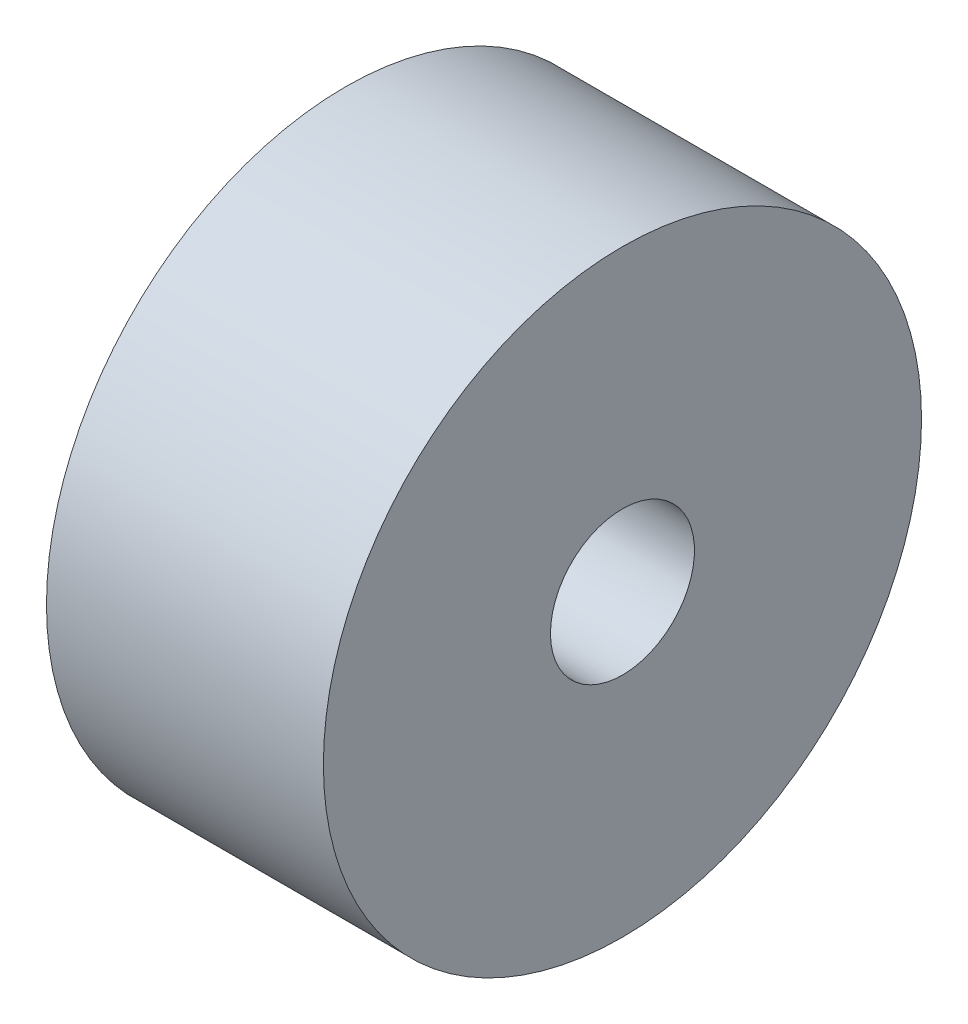
ISO-10303-21;
HEADER;
FILE_DESCRIPTION(('STEP AP214'),'2;1');
FILE_NAME('part.step','',(''),(''),'','','');
FILE_SCHEMA(('AUTOMOTIVE_DESIGN { 1 0 10303 214 1 1 1 1 }'));
ENDSEC;
DATA;
#1=APPLICATION_CONTEXT('core data for automotive mechanical design processes');
#2=APPLICATION_PROTOCOL_DEFINITION('international standard','automotive_design',2000,#1);
#3=PRODUCT_CONTEXT('',#1,'mechanical');
#4=PRODUCT('Part','Part','',(#3));
#5=PRODUCT_RELATED_PRODUCT_CATEGORY('part','',(#4));
#6=PRODUCT_DEFINITION_FORMATION('','',#4);
#7=PRODUCT_DEFINITION_CONTEXT('part definition',#1,'design');
#8=PRODUCT_DEFINITION('design','',#6,#7);
#9=PRODUCT_DEFINITION_SHAPE('','',#8);
#10=(LENGTH_UNIT() NAMED_UNIT(*) SI_UNIT(.MILLI.,.METRE.));
#11=(NAMED_UNIT(*) PLANE_ANGLE_UNIT() SI_UNIT($,.RADIAN.));
#12=(NAMED_UNIT(*) SI_UNIT($,.STERADIAN.) SOLID_ANGLE_UNIT());
#13=UNCERTAINTY_MEASURE_WITH_UNIT(LENGTH_MEASURE(1.E-05),#10,'distance_accuracy_value','');
#14=(GEOMETRIC_REPRESENTATION_CONTEXT(3) GLOBAL_UNCERTAINTY_ASSIGNED_CONTEXT((#13)) GLOBAL_UNIT_ASSIGNED_CONTEXT((#10,
#11,#12)) REPRESENTATION_CONTEXT('',''));
#15=CARTESIAN_POINT('',(0.,0.,0.));
#16=DIRECTION('',(0.,0.,1.));
#17=DIRECTION('',(1.,0.,0.));
#18=AXIS2_PLACEMENT_3D('',#15,#16,#17);
#19=CARTESIAN_POINT('',(0.,0.,0.));
#20=DIRECTION('',(-1.,0.,0.));
#21=DIRECTION('',(0.,0.,1.));
#22=AXIS2_PLACEMENT_3D('',#19,#20,#21);
#23=CYLINDRICAL_SURFACE('',#22,27.);
#24=CARTESIAN_POINT('',(12.5,0.,0.));
#25=DIRECTION('',(-1.,0.,0.));
#26=DIRECTION('',(0.,0.,1.));
#27=AXIS2_PLACEMENT_3D('',#24,#25,#26);
#28=CIRCLE('',#27,27.);
#29=CARTESIAN_POINT('',(12.5,0.,27.));
#30=VERTEX_POINT('',#29);
#31=EDGE_CURVE('E46',#30,#30,#28,.T.);
#32=ORIENTED_EDGE('',*,*,#31,.T.);
#33=EDGE_LOOP('',(#32));
#34=FACE_BOUND('',#33,.T.);
#35=CARTESIAN_POINT('',(-12.5,0.,0.));
#36=DIRECTION('',(-1.,0.,0.));
#37=DIRECTION('',(0.,0.,1.));
#38=AXIS2_PLACEMENT_3D('',#35,#36,#37);
#39=CIRCLE('',#38,27.);
#40=CARTESIAN_POINT('',(-12.5,0.,27.));
#41=VERTEX_POINT('',#40);
#42=EDGE_CURVE('E10',#41,#41,#39,.T.);
#43=ORIENTED_EDGE('',*,*,#42,.F.);
#44=EDGE_LOOP('',(#43));
#45=FACE_BOUND('',#44,.T.);
#46=ADVANCED_FACE('F32',(#34,#45),#23,.T.);
#47=CARTESIAN_POINT('',(-12.5,0.,0.));
#48=DIRECTION('',(-1.,0.,0.));
#49=DIRECTION('',(0.,0.,1.));
#50=AXIS2_PLACEMENT_3D('',#47,#48,#49);
#51=PLANE('',#50);
#52=ORIENTED_EDGE('',*,*,#42,.T.);
#53=EDGE_LOOP('',(#52));
#54=FACE_BOUND('',#53,.T.);
#55=CARTESIAN_POINT('',(-12.5,0.,0.));
#56=DIRECTION('',(-1.,0.,0.));
#57=DIRECTION('',(0.,0.,1.));
#58=AXIS2_PLACEMENT_3D('',#55,#56,#57);
#59=CIRCLE('',#58,6.5);
#60=CARTESIAN_POINT('',(-12.5,0.,6.5));
#61=VERTEX_POINT('',#60);
#62=EDGE_CURVE('E38',#61,#61,#59,.T.);
#63=ORIENTED_EDGE('',*,*,#62,.F.);
#64=EDGE_LOOP('',(#63));
#65=FACE_BOUND('',#64,.T.);
#66=ADVANCED_FACE('F62',(#54,#65),#51,.T.);
#67=CARTESIAN_POINT('',(0.,0.,0.));
#68=DIRECTION('',(-1.,0.,0.));
#69=DIRECTION('',(0.,0.,1.));
#70=AXIS2_PLACEMENT_3D('',#67,#68,#69);
#71=CYLINDRICAL_SURFACE('',#70,6.5);
#72=ORIENTED_EDGE('',*,*,#62,.T.);
#73=EDGE_LOOP('',(#72));
#74=FACE_BOUND('',#73,.T.);
#75=CARTESIAN_POINT('',(12.5,0.,0.));
#76=DIRECTION('',(-1.,0.,0.));
#77=DIRECTION('',(0.,0.,1.));
#78=AXIS2_PLACEMENT_3D('',#75,#76,#77);
#79=CIRCLE('',#78,6.5);
#80=CARTESIAN_POINT('',(12.5,0.,6.5));
#81=VERTEX_POINT('',#80);
#82=EDGE_CURVE('E42',#81,#81,#79,.T.);
#83=ORIENTED_EDGE('',*,*,#82,.F.);
#84=EDGE_LOOP('',(#83));
#85=FACE_BOUND('',#84,.T.);
#86=ADVANCED_FACE('F56',(#74,#85),#71,.F.);
#87=CARTESIAN_POINT('',(12.5,0.,0.));
#88=DIRECTION('',(1.,0.,0.));
#89=DIRECTION('',(0.,0.,-1.));
#90=AXIS2_PLACEMENT_3D('',#87,#88,#89);
#91=PLANE('',#90);
#92=ORIENTED_EDGE('',*,*,#82,.T.);
#93=EDGE_LOOP('',(#92));
#94=FACE_BOUND('',#93,.T.);
#95=ORIENTED_EDGE('',*,*,#31,.F.);
#96=EDGE_LOOP('',(#95));
#97=FACE_BOUND('',#96,.T.);
#98=ADVANCED_FACE('F54',(#94,#97),#91,.T.);
#99=CLOSED_SHELL('',(#46,#66,#86,#98));
#100=MANIFOLD_SOLID_BREP('B2',#99);
#101=ADVANCED_BREP_SHAPE_REPRESENTATION('',(#18,#100),#14);
#102=SHAPE_DEFINITION_REPRESENTATION(#9,#101);
ENDSEC;
END-ISO-10303-21;
